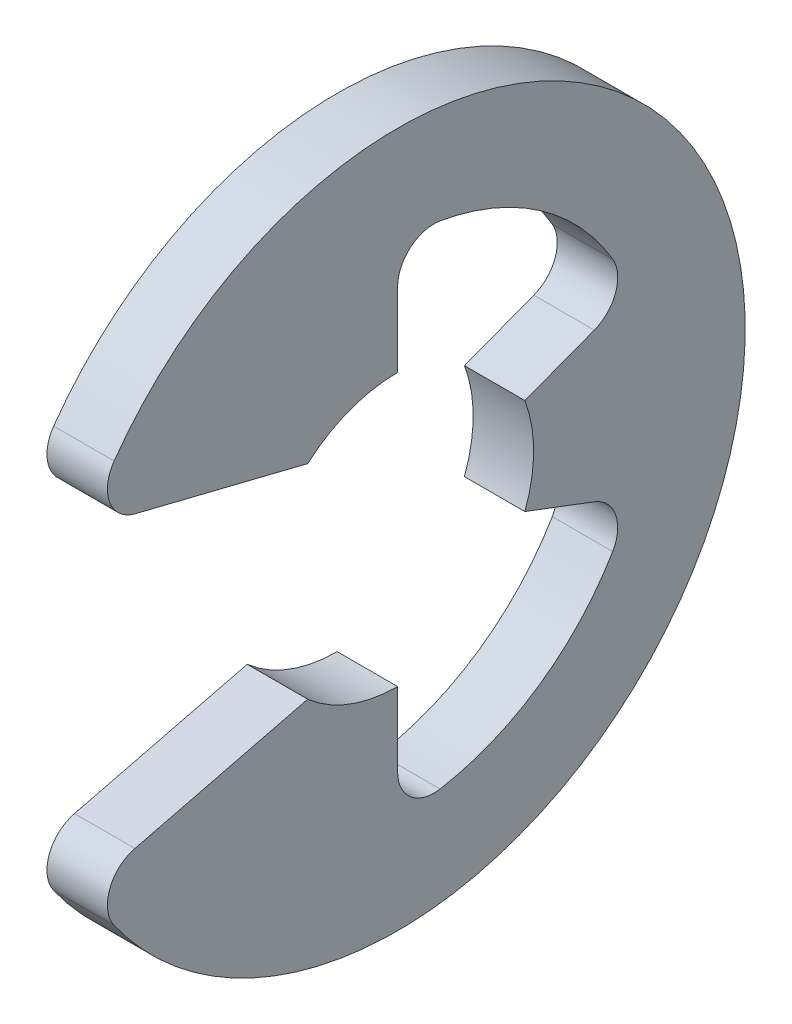
ISO-10303-21;
HEADER;
FILE_DESCRIPTION(('STEP AP214'),'2;1');
FILE_NAME('part.step','',(''),(''),'','','');
FILE_SCHEMA(('AUTOMOTIVE_DESIGN { 1 0 10303 214 1 1 1 1 }'));
ENDSEC;
DATA;
#1=APPLICATION_CONTEXT('core data for automotive mechanical design processes');
#2=APPLICATION_PROTOCOL_DEFINITION('international standard','automotive_design',2000,#1);
#3=PRODUCT_CONTEXT('',#1,'mechanical');
#4=PRODUCT('Part','Part','',(#3));
#5=PRODUCT_RELATED_PRODUCT_CATEGORY('part','',(#4));
#6=PRODUCT_DEFINITION_FORMATION('','',#4);
#7=PRODUCT_DEFINITION_CONTEXT('part definition',#1,'design');
#8=PRODUCT_DEFINITION('design','',#6,#7);
#9=PRODUCT_DEFINITION_SHAPE('','',#8);
#10=(LENGTH_UNIT() NAMED_UNIT(*) SI_UNIT(.MILLI.,.METRE.));
#11=(NAMED_UNIT(*) PLANE_ANGLE_UNIT() SI_UNIT($,.RADIAN.));
#12=(NAMED_UNIT(*) SI_UNIT($,.STERADIAN.) SOLID_ANGLE_UNIT());
#13=UNCERTAINTY_MEASURE_WITH_UNIT(LENGTH_MEASURE(1.E-05),#10,'distance_accuracy_value','');
#14=(GEOMETRIC_REPRESENTATION_CONTEXT(3) GLOBAL_UNCERTAINTY_ASSIGNED_CONTEXT((#13)) GLOBAL_UNIT_ASSIGNED_CONTEXT((#10,
#11,#12)) REPRESENTATION_CONTEXT('',''));
#15=CARTESIAN_POINT('',(0.,0.,0.));
#16=DIRECTION('',(0.,0.,1.));
#17=DIRECTION('',(1.,0.,0.));
#18=AXIS2_PLACEMENT_3D('',#15,#16,#17);
#19=CARTESIAN_POINT('',(-0.3,0.,0.));
#20=DIRECTION('',(1.,0.,0.));
#21=DIRECTION('',(0.,0.,-1.));
#22=AXIS2_PLACEMENT_3D('',#19,#20,#21);
#23=PLANE('',#22);
#24=CARTESIAN_POINT('',(-0.3,-1.78749999611696,2.52050466452294));
#25=DIRECTION('',(-1.,0.,0.));
#26=DIRECTION('',(0.,0.,1.));
#27=AXIS2_PLACEMENT_3D('',#24,#25,#26);
#28=CIRCLE('',#27,0.36);
#29=CARTESIAN_POINT('',(-0.3,-1.43810673734382,2.60724767994141));
#30=VERTEX_POINT('',#29);
#31=CARTESIAN_POINT('',(-0.3,-1.99575242284903,2.8141556933994));
#32=VERTEX_POINT('',#31);
#33=EDGE_CURVE('E204',#30,#32,#28,.F.);
#34=ORIENTED_EDGE('',*,*,#33,.F.);
#35=DIRECTION('',(0.,0.240952820606872,-0.970536829925373));
#36=VECTOR('',#35,1.);
#37=CARTESIAN_POINT('',(-0.3,-1.55535385551941,3.07950878942095));
#38=LINE('',#37,#36);
#39=CARTESIAN_POINT('',(-0.3,-1.0125,0.8929410674843));
#40=VERTEX_POINT('',#39);
#41=EDGE_CURVE('E208',#30,#40,#38,.T.);
#42=ORIENTED_EDGE('',*,*,#41,.T.);
#43=CARTESIAN_POINT('',(-0.3,0.,0.));
#44=DIRECTION('',(-1.,0.,0.));
#45=DIRECTION('',(0.,0.,1.));
#46=AXIS2_PLACEMENT_3D('',#43,#44,#45);
#47=CIRCLE('',#46,1.35);
#48=CARTESIAN_POINT('',(-0.3,-1.35,0.));
#49=VERTEX_POINT('',#48);
#50=EDGE_CURVE('E211',#49,#40,#47,.T.);
#51=ORIENTED_EDGE('',*,*,#50,.F.);
#52=DIRECTION('',(0.,1.,0.));
#53=VECTOR('',#52,1.);
#54=CARTESIAN_POINT('',(-0.3,0.,0.));
#55=LINE('',#54,#53);
#56=CARTESIAN_POINT('',(-0.3,-2.08659165249111,0.));
#57=VERTEX_POINT('',#56);
#58=EDGE_CURVE('E144',#57,#49,#55,.T.);
#59=ORIENTED_EDGE('',*,*,#58,.F.);
#60=CARTESIAN_POINT('',(-0.3,-2.08659165249111,-0.359999999999999));
#61=DIRECTION('',(-1.,0.,0.));
#62=DIRECTION('',(0.,0.,1.));
#63=AXIS2_PLACEMENT_3D('',#60,#61,#62);
#64=CIRCLE('',#63,0.36);
#65=CARTESIAN_POINT('',(-0.3,-2.44135037951428,-0.421206581352832));
#66=VERTEX_POINT('',#65);
#67=EDGE_CURVE('E20',#66,#57,#64,.T.);
#68=ORIENTED_EDGE('',*,*,#67,.F.);
#69=CARTESIAN_POINT('',(-0.3,0.,0.));
#70=DIRECTION('',(-1.,0.,0.));
#71=DIRECTION('',(0.,0.,1.));
#72=AXIS2_PLACEMENT_3D('',#69,#70,#71);
#73=CIRCLE('',#72,2.47741935483871);
#74=CARTESIAN_POINT('',(-0.3,-1.25715038342261,-2.13475515532574));
#75=VERTEX_POINT('',#74);
#76=EDGE_CURVE('E141',#66,#75,#73,.F.);
#77=ORIENTED_EDGE('',*,*,#76,.T.);
#78=CARTESIAN_POINT('',(-0.3,-1.07447071833151,-1.82454854681747));
#79=DIRECTION('',(-1.,0.,0.));
#80=DIRECTION('',(0.,0.,1.));
#81=AXIS2_PLACEMENT_3D('',#78,#79,#80);
#82=CIRCLE('',#81,0.36);
#83=CARTESIAN_POINT('',(-0.3,-0.737721553521855,-1.95182776743105));
#84=VERTEX_POINT('',#83);
#85=EDGE_CURVE('E167',#75,#84,#82,.F.);
#86=ORIENTED_EDGE('',*,*,#85,.T.);
#87=DIRECTION('',(0.,0.353553390593277,0.935414346693484));
#88=VECTOR('',#87,1.);
#89=CARTESIAN_POINT('',(-0.3,-0.477297077300919,-1.26280936803621));
#90=LINE('',#89,#88);
#91=CARTESIAN_POINT('',(-0.3,-0.477297077300919,-1.26280936803621));
#92=VERTEX_POINT('',#91);
#93=EDGE_CURVE('E170',#84,#92,#90,.T.);
#94=ORIENTED_EDGE('',*,*,#93,.T.);
#95=CARTESIAN_POINT('',(-0.3,0.,0.));
#96=DIRECTION('',(-1.,0.,0.));
#97=DIRECTION('',(0.,0.,1.));
#98=AXIS2_PLACEMENT_3D('',#95,#96,#97);
#99=CIRCLE('',#98,1.35);
#100=CARTESIAN_POINT('',(-0.3,0.477297077300919,-1.26280936803621));
#101=VERTEX_POINT('',#100);
#102=EDGE_CURVE('E171',#92,#101,#99,.F.);
#103=ORIENTED_EDGE('',*,*,#102,.T.);
#104=DIRECTION('',(0.,0.353553390593278,-0.935414346693484));
#105=VECTOR('',#104,1.);
#106=CARTESIAN_POINT('',(-0.3,0.477297077300919,-1.26280936803621));
#107=LINE('',#106,#105);
#108=CARTESIAN_POINT('',(-0.3,0.737721553521856,-1.95182776743105));
#109=VERTEX_POINT('',#108);
#110=EDGE_CURVE('E176',#101,#109,#107,.T.);
#111=ORIENTED_EDGE('',*,*,#110,.T.);
#112=CARTESIAN_POINT('',(-0.3,1.07447071833151,-1.82454854681747));
#113=DIRECTION('',(-1.,0.,0.));
#114=DIRECTION('',(0.,0.,1.));
#115=AXIS2_PLACEMENT_3D('',#112,#113,#114);
#116=CIRCLE('',#115,0.36);
#117=CARTESIAN_POINT('',(-0.3,1.25715038342261,-2.13475515532574));
#118=VERTEX_POINT('',#117);
#119=EDGE_CURVE('E179',#109,#118,#116,.F.);
#120=ORIENTED_EDGE('',*,*,#119,.T.);
#121=CARTESIAN_POINT('',(-0.3,0.,0.));
#122=DIRECTION('',(-1.,0.,0.));
#123=DIRECTION('',(0.,0.,1.));
#124=AXIS2_PLACEMENT_3D('',#121,#122,#123);
#125=CIRCLE('',#124,2.47741935483871);
#126=CARTESIAN_POINT('',(-0.3,2.44135037951428,-0.421206581352832));
#127=VERTEX_POINT('',#126);
#128=EDGE_CURVE('E182',#118,#127,#125,.F.);
#129=ORIENTED_EDGE('',*,*,#128,.T.);
#130=CARTESIAN_POINT('',(-0.3,2.08659165249111,-0.359999999999998));
#131=DIRECTION('',(-1.,0.,0.));
#132=DIRECTION('',(0.,0.,1.));
#133=AXIS2_PLACEMENT_3D('',#130,#131,#132);
#134=CIRCLE('',#133,0.36);
#135=CARTESIAN_POINT('',(-0.3,2.08659165249111,0.));
#136=VERTEX_POINT('',#135);
#137=EDGE_CURVE('E185',#127,#136,#134,.F.);
#138=ORIENTED_EDGE('',*,*,#137,.T.);
#139=DIRECTION('',(0.,-1.,0.));
#140=VECTOR('',#139,1.);
#141=CARTESIAN_POINT('',(-0.3,1.35,0.));
#142=LINE('',#141,#140);
#143=CARTESIAN_POINT('',(-0.3,1.35,0.));
#144=VERTEX_POINT('',#143);
#145=EDGE_CURVE('E188',#136,#144,#142,.T.);
#146=ORIENTED_EDGE('',*,*,#145,.T.);
#147=CARTESIAN_POINT('',(-0.3,0.,0.));
#148=DIRECTION('',(-1.,0.,0.));
#149=DIRECTION('',(0.,0.,1.));
#150=AXIS2_PLACEMENT_3D('',#147,#148,#149);
#151=CIRCLE('',#150,1.35);
#152=CARTESIAN_POINT('',(-0.3,1.0125,0.8929410674843));
#153=VERTEX_POINT('',#152);
#154=EDGE_CURVE('E189',#144,#153,#151,.F.);
#155=ORIENTED_EDGE('',*,*,#154,.T.);
#156=DIRECTION('',(0.,0.240952820606871,0.970536829925373));
#157=VECTOR('',#156,1.);
#158=CARTESIAN_POINT('',(-0.3,1.55535385551941,3.07950878942095));
#159=LINE('',#158,#157);
#160=CARTESIAN_POINT('',(-0.3,1.43810673734382,2.60724767994141));
#161=VERTEX_POINT('',#160);
#162=EDGE_CURVE('E195',#153,#161,#159,.T.);
#163=ORIENTED_EDGE('',*,*,#162,.T.);
#164=CARTESIAN_POINT('',(-0.3,1.78749999611695,2.52050466452294));
#165=DIRECTION('',(-1.,0.,0.));
#166=DIRECTION('',(0.,0.,1.));
#167=AXIS2_PLACEMENT_3D('',#164,#165,#166);
#168=CIRCLE('',#167,0.36);
#169=CARTESIAN_POINT('',(-0.3,1.99575242284903,2.8141556933994));
#170=VERTEX_POINT('',#169);
#171=EDGE_CURVE('E199',#170,#161,#168,.F.);
#172=ORIENTED_EDGE('',*,*,#171,.F.);
#173=CARTESIAN_POINT('',(-0.3,0.,0.));
#174=DIRECTION('',(-1.,0.,0.));
#175=DIRECTION('',(0.,0.,1.));
#176=AXIS2_PLACEMENT_3D('',#173,#174,#175);
#177=CIRCLE('',#176,3.45);
#178=EDGE_CURVE('E200',#32,#170,#177,.F.);
#179=ORIENTED_EDGE('',*,*,#178,.F.);
#180=EDGE_LOOP('',(#34,#42,#51,#59,#68,#77,#86,#94,#103,#111,#120,#129,#138,#146,#155,#163,#172,#179));
#181=FACE_BOUND('',#180,.T.);
#182=ADVANCED_FACE('F17',(#181),#23,.F.);
#183=CARTESIAN_POINT('',(0.3,-1.55535385551941,3.07950878942095));
#184=DIRECTION('',(0.,-0.970536829925373,-0.240952820606872));
#185=DIRECTION('',(0.,0.240952820606872,-0.970536829925373));
#186=AXIS2_PLACEMENT_3D('',#183,#184,#185);
#187=PLANE('',#186);
#188=DIRECTION('',(-1.,0.,0.));
#189=VECTOR('',#188,1.);
#190=CARTESIAN_POINT('',(0.3,-1.43810673734382,2.60724767994141));
#191=LINE('',#190,#189);
#192=CARTESIAN_POINT('',(0.3,-1.43810673734382,2.60724767994141));
#193=VERTEX_POINT('',#192);
#194=EDGE_CURVE('E205',#193,#30,#191,.T.);
#195=ORIENTED_EDGE('',*,*,#194,.F.);
#196=DIRECTION('',(0.,-0.240952820606872,0.970536829925373));
#197=VECTOR('',#196,1.);
#198=CARTESIAN_POINT('',(0.3,-1.0125,0.8929410674843));
#199=LINE('',#198,#197);
#200=CARTESIAN_POINT('',(0.3,-1.0125,0.8929410674843));
#201=VERTEX_POINT('',#200);
#202=EDGE_CURVE('E250',#201,#193,#199,.T.);
#203=ORIENTED_EDGE('',*,*,#202,.F.);
#204=DIRECTION('',(-1.,0.,0.));
#205=VECTOR('',#204,1.);
#206=CARTESIAN_POINT('',(0.3,-1.0125,0.8929410674843));
#207=LINE('',#206,#205);
#208=EDGE_CURVE('E268',#201,#40,#207,.T.);
#209=ORIENTED_EDGE('',*,*,#208,.T.);
#210=ORIENTED_EDGE('',*,*,#41,.F.);
#211=EDGE_LOOP('',(#195,#203,#209,#210));
#212=FACE_BOUND('',#211,.T.);
#213=ADVANCED_FACE('F272',(#212),#187,.F.);
#214=CARTESIAN_POINT('',(0.3,-1.78749999611696,2.52050466452294));
#215=DIRECTION('',(-1.,0.,0.));
#216=DIRECTION('',(0.,0.,1.));
#217=AXIS2_PLACEMENT_3D('',#214,#215,#216);
#218=CYLINDRICAL_SURFACE('',#217,0.36);
#219=ORIENTED_EDGE('',*,*,#33,.T.);
#220=DIRECTION('',(-1.,0.,0.));
#221=VECTOR('',#220,1.);
#222=CARTESIAN_POINT('',(0.3,-1.99575242284903,2.8141556933994));
#223=LINE('',#222,#221);
#224=CARTESIAN_POINT('',(0.3,-1.99575242284903,2.8141556933994));
#225=VERTEX_POINT('',#224);
#226=EDGE_CURVE('E201',#225,#32,#223,.T.);
#227=ORIENTED_EDGE('',*,*,#226,.F.);
#228=CARTESIAN_POINT('',(0.3,-1.78749999611696,2.52050466452294));
#229=DIRECTION('',(-1.,0.,0.));
#230=DIRECTION('',(0.,0.,1.));
#231=AXIS2_PLACEMENT_3D('',#228,#229,#230);
#232=CIRCLE('',#231,0.36);
#233=EDGE_CURVE('E249',#193,#225,#232,.F.);
#234=ORIENTED_EDGE('',*,*,#233,.F.);
#235=ORIENTED_EDGE('',*,*,#194,.T.);
#236=EDGE_LOOP('',(#219,#227,#234,#235));
#237=FACE_BOUND('',#236,.T.);
#238=ADVANCED_FACE('F449',(#237),#218,.T.);
#239=CARTESIAN_POINT('',(0.3,0.,0.));
#240=DIRECTION('',(-1.,0.,0.));
#241=DIRECTION('',(0.,0.,1.));
#242=AXIS2_PLACEMENT_3D('',#239,#240,#241);
#243=CYLINDRICAL_SURFACE('',#242,3.45);
#244=ORIENTED_EDGE('',*,*,#178,.T.);
#245=DIRECTION('',(-1.,0.,0.));
#246=VECTOR('',#245,1.);
#247=CARTESIAN_POINT('',(0.3,1.99575242284903,2.8141556933994));
#248=LINE('',#247,#246);
#249=CARTESIAN_POINT('',(0.3,1.99575242284903,2.8141556933994));
#250=VERTEX_POINT('',#249);
#251=EDGE_CURVE('E196',#250,#170,#248,.T.);
#252=ORIENTED_EDGE('',*,*,#251,.F.);
#253=CARTESIAN_POINT('',(0.3,0.,0.));
#254=DIRECTION('',(-1.,0.,0.));
#255=DIRECTION('',(0.,0.,1.));
#256=AXIS2_PLACEMENT_3D('',#253,#254,#255);
#257=CIRCLE('',#256,3.45);
#258=EDGE_CURVE('E246',#225,#250,#257,.F.);
#259=ORIENTED_EDGE('',*,*,#258,.F.);
#260=ORIENTED_EDGE('',*,*,#226,.T.);
#261=EDGE_LOOP('',(#244,#252,#259,#260));
#262=FACE_BOUND('',#261,.T.);
#263=ADVANCED_FACE('F439',(#262),#243,.T.);
#264=CARTESIAN_POINT('',(0.3,1.78749999611695,2.52050466452294));
#265=DIRECTION('',(-1.,0.,0.));
#266=DIRECTION('',(0.,0.,1.));
#267=AXIS2_PLACEMENT_3D('',#264,#265,#266);
#268=CYLINDRICAL_SURFACE('',#267,0.36);
#269=ORIENTED_EDGE('',*,*,#171,.T.);
#270=DIRECTION('',(1.,0.,0.));
#271=VECTOR('',#270,1.);
#272=CARTESIAN_POINT('',(0.3,1.43810673734382,2.60724767994141));
#273=LINE('',#272,#271);
#274=CARTESIAN_POINT('',(0.3,1.43810673734382,2.60724767994141));
#275=VERTEX_POINT('',#274);
#276=EDGE_CURVE('E192',#161,#275,#273,.T.);
#277=ORIENTED_EDGE('',*,*,#276,.T.);
#278=CARTESIAN_POINT('',(0.3,1.78749999611695,2.52050466452294));
#279=DIRECTION('',(-1.,0.,0.));
#280=DIRECTION('',(0.,0.,1.));
#281=AXIS2_PLACEMENT_3D('',#278,#279,#280);
#282=CIRCLE('',#281,0.36);
#283=EDGE_CURVE('E244',#250,#275,#282,.F.);
#284=ORIENTED_EDGE('',*,*,#283,.F.);
#285=ORIENTED_EDGE('',*,*,#251,.T.);
#286=EDGE_LOOP('',(#269,#277,#284,#285));
#287=FACE_BOUND('',#286,.T.);
#288=ADVANCED_FACE('F429',(#287),#268,.T.);
#289=CARTESIAN_POINT('',(0.3,1.55535385551941,3.07950878942095));
#290=DIRECTION('',(0.,0.970536829925373,-0.240952820606871));
#291=DIRECTION('',(0.,0.240952820606871,0.970536829925373));
#292=AXIS2_PLACEMENT_3D('',#289,#290,#291);
#293=PLANE('',#292);
#294=ORIENTED_EDGE('',*,*,#276,.F.);
#295=ORIENTED_EDGE('',*,*,#162,.F.);
#296=DIRECTION('',(-1.,0.,0.));
#297=VECTOR('',#296,1.);
#298=CARTESIAN_POINT('',(0.3,1.0125,0.8929410674843));
#299=LINE('',#298,#297);
#300=CARTESIAN_POINT('',(0.3,1.0125,0.8929410674843));
#301=VERTEX_POINT('',#300);
#302=EDGE_CURVE('E190',#153,#301,#299,.F.);
#303=ORIENTED_EDGE('',*,*,#302,.T.);
#304=DIRECTION('',(0.,-0.240952820606871,-0.970536829925373));
#305=VECTOR('',#304,1.);
#306=CARTESIAN_POINT('',(0.3,1.43810673734382,2.60724767994141));
#307=LINE('',#306,#305);
#308=EDGE_CURVE('E243',#275,#301,#307,.T.);
#309=ORIENTED_EDGE('',*,*,#308,.F.);
#310=EDGE_LOOP('',(#294,#295,#303,#309));
#311=FACE_BOUND('',#310,.T.);
#312=ADVANCED_FACE('F419',(#311),#293,.F.);
#313=CARTESIAN_POINT('',(0.3,0.,0.));
#314=DIRECTION('',(-1.,0.,0.));
#315=DIRECTION('',(0.,0.,1.));
#316=AXIS2_PLACEMENT_3D('',#313,#314,#315);
#317=CYLINDRICAL_SURFACE('',#316,1.35);
#318=DIRECTION('',(1.,0.,0.));
#319=VECTOR('',#318,1.);
#320=CARTESIAN_POINT('',(0.3,1.35,0.));
#321=LINE('',#320,#319);
#322=CARTESIAN_POINT('',(0.3,1.35,0.));
#323=VERTEX_POINT('',#322);
#324=EDGE_CURVE('E186',#144,#323,#321,.T.);
#325=ORIENTED_EDGE('',*,*,#324,.T.);
#326=CARTESIAN_POINT('',(0.3,0.,0.));
#327=DIRECTION('',(-1.,0.,0.));
#328=DIRECTION('',(0.,0.,1.));
#329=AXIS2_PLACEMENT_3D('',#326,#327,#328);
#330=CIRCLE('',#329,1.35);
#331=EDGE_CURVE('E240',#301,#323,#330,.T.);
#332=ORIENTED_EDGE('',*,*,#331,.F.);
#333=ORIENTED_EDGE('',*,*,#302,.F.);
#334=ORIENTED_EDGE('',*,*,#154,.F.);
#335=EDGE_LOOP('',(#325,#332,#333,#334));
#336=FACE_BOUND('',#335,.T.);
#337=ADVANCED_FACE('F409',(#336),#317,.F.);
#338=CARTESIAN_POINT('',(0.3,1.35,0.));
#339=DIRECTION('',(0.,0.,1.));
#340=DIRECTION('',(0.,-1.,0.));
#341=AXIS2_PLACEMENT_3D('',#338,#339,#340);
#342=PLANE('',#341);
#343=DIRECTION('',(-1.,0.,0.));
#344=VECTOR('',#343,1.);
#345=CARTESIAN_POINT('',(0.3,2.08659165249111,0.));
#346=LINE('',#345,#344);
#347=CARTESIAN_POINT('',(0.3,2.08659165249111,0.));
#348=VERTEX_POINT('',#347);
#349=EDGE_CURVE('E183',#136,#348,#346,.F.);
#350=ORIENTED_EDGE('',*,*,#349,.T.);
#351=DIRECTION('',(0.,1.,0.));
#352=VECTOR('',#351,1.);
#353=CARTESIAN_POINT('',(0.3,0.,0.));
#354=LINE('',#353,#352);
#355=EDGE_CURVE('E239',#323,#348,#354,.T.);
#356=ORIENTED_EDGE('',*,*,#355,.F.);
#357=ORIENTED_EDGE('',*,*,#324,.F.);
#358=ORIENTED_EDGE('',*,*,#145,.F.);
#359=EDGE_LOOP('',(#350,#356,#357,#358));
#360=FACE_BOUND('',#359,.T.);
#361=ADVANCED_FACE('F399',(#360),#342,.F.);
#362=CARTESIAN_POINT('',(0.3,2.08659165249111,-0.359999999999998));
#363=DIRECTION('',(-1.,0.,0.));
#364=DIRECTION('',(0.,0.,1.));
#365=AXIS2_PLACEMENT_3D('',#362,#363,#364);
#366=CYLINDRICAL_SURFACE('',#365,0.36);
#367=ORIENTED_EDGE('',*,*,#349,.F.);
#368=ORIENTED_EDGE('',*,*,#137,.F.);
#369=DIRECTION('',(-1.,0.,0.));
#370=VECTOR('',#369,1.);
#371=CARTESIAN_POINT('',(0.3,2.44135037951428,-0.421206581352832));
#372=LINE('',#371,#370);
#373=CARTESIAN_POINT('',(0.3,2.44135037951428,-0.421206581352832));
#374=VERTEX_POINT('',#373);
#375=EDGE_CURVE('E180',#127,#374,#372,.F.);
#376=ORIENTED_EDGE('',*,*,#375,.T.);
#377=CARTESIAN_POINT('',(0.3,2.08659165249111,-0.359999999999998));
#378=DIRECTION('',(-1.,0.,0.));
#379=DIRECTION('',(0.,0.,1.));
#380=AXIS2_PLACEMENT_3D('',#377,#378,#379);
#381=CIRCLE('',#380,0.36);
#382=EDGE_CURVE('E236',#348,#374,#381,.T.);
#383=ORIENTED_EDGE('',*,*,#382,.F.);
#384=EDGE_LOOP('',(#367,#368,#376,#383));
#385=FACE_BOUND('',#384,.T.);
#386=ADVANCED_FACE('F389',(#385),#366,.F.);
#387=CARTESIAN_POINT('',(0.3,0.,0.));
#388=DIRECTION('',(-1.,0.,0.));
#389=DIRECTION('',(0.,0.,1.));
#390=AXIS2_PLACEMENT_3D('',#387,#388,#389);
#391=CYLINDRICAL_SURFACE('',#390,2.47741935483871);
#392=ORIENTED_EDGE('',*,*,#375,.F.);
#393=ORIENTED_EDGE('',*,*,#128,.F.);
#394=DIRECTION('',(-1.,0.,0.));
#395=VECTOR('',#394,1.);
#396=CARTESIAN_POINT('',(0.3,1.25715038342261,-2.13475515532574));
#397=LINE('',#396,#395);
#398=CARTESIAN_POINT('',(0.3,1.25715038342261,-2.13475515532574));
#399=VERTEX_POINT('',#398);
#400=EDGE_CURVE('E177',#118,#399,#397,.F.);
#401=ORIENTED_EDGE('',*,*,#400,.T.);
#402=CARTESIAN_POINT('',(0.3,0.,0.));
#403=DIRECTION('',(-1.,0.,0.));
#404=DIRECTION('',(0.,0.,1.));
#405=AXIS2_PLACEMENT_3D('',#402,#403,#404);
#406=CIRCLE('',#405,2.47741935483871);
#407=EDGE_CURVE('E233',#374,#399,#406,.T.);
#408=ORIENTED_EDGE('',*,*,#407,.F.);
#409=EDGE_LOOP('',(#392,#393,#401,#408));
#410=FACE_BOUND('',#409,.T.);
#411=ADVANCED_FACE('F379',(#410),#391,.F.);
#412=CARTESIAN_POINT('',(0.3,1.07447071833151,-1.82454854681747));
#413=DIRECTION('',(-1.,0.,0.));
#414=DIRECTION('',(0.,0.,1.));
#415=AXIS2_PLACEMENT_3D('',#412,#413,#414);
#416=CYLINDRICAL_SURFACE('',#415,0.36);
#417=ORIENTED_EDGE('',*,*,#400,.F.);
#418=ORIENTED_EDGE('',*,*,#119,.F.);
#419=DIRECTION('',(1.,0.,0.));
#420=VECTOR('',#419,1.);
#421=CARTESIAN_POINT('',(0.3,0.737721553521856,-1.95182776743105));
#422=LINE('',#421,#420);
#423=CARTESIAN_POINT('',(0.3,0.737721553521856,-1.95182776743105));
#424=VERTEX_POINT('',#423);
#425=EDGE_CURVE('E174',#109,#424,#422,.T.);
#426=ORIENTED_EDGE('',*,*,#425,.T.);
#427=CARTESIAN_POINT('',(0.3,1.07447071833151,-1.82454854681747));
#428=DIRECTION('',(-1.,0.,0.));
#429=DIRECTION('',(0.,0.,1.));
#430=AXIS2_PLACEMENT_3D('',#427,#428,#429);
#431=CIRCLE('',#430,0.36);
#432=EDGE_CURVE('E230',#399,#424,#431,.T.);
#433=ORIENTED_EDGE('',*,*,#432,.F.);
#434=EDGE_LOOP('',(#417,#418,#426,#433));
#435=FACE_BOUND('',#434,.T.);
#436=ADVANCED_FACE('F369',(#435),#416,.F.);
#437=CARTESIAN_POINT('',(0.3,0.477297077300919,-1.26280936803621));
#438=DIRECTION('',(0.,-0.935414346693484,-0.353553390593278));
#439=DIRECTION('',(0.,0.353553390593278,-0.935414346693484));
#440=AXIS2_PLACEMENT_3D('',#437,#438,#439);
#441=PLANE('',#440);
#442=ORIENTED_EDGE('',*,*,#425,.F.);
#443=ORIENTED_EDGE('',*,*,#110,.F.);
#444=DIRECTION('',(-1.,0.,0.));
#445=VECTOR('',#444,1.);
#446=CARTESIAN_POINT('',(0.3,0.477297077300919,-1.26280936803621));
#447=LINE('',#446,#445);
#448=CARTESIAN_POINT('',(0.3,0.477297077300919,-1.26280936803621));
#449=VERTEX_POINT('',#448);
#450=EDGE_CURVE('E172',#101,#449,#447,.F.);
#451=ORIENTED_EDGE('',*,*,#450,.T.);
#452=DIRECTION('',(0.,-0.353553390593278,0.935414346693484));
#453=VECTOR('',#452,1.);
#454=CARTESIAN_POINT('',(0.3,0.737721553521856,-1.95182776743105));
#455=LINE('',#454,#453);
#456=EDGE_CURVE('E229',#424,#449,#455,.T.);
#457=ORIENTED_EDGE('',*,*,#456,.F.);
#458=EDGE_LOOP('',(#442,#443,#451,#457));
#459=FACE_BOUND('',#458,.T.);
#460=ADVANCED_FACE('F359',(#459),#441,.F.);
#461=CARTESIAN_POINT('',(0.3,0.,0.));
#462=DIRECTION('',(-1.,0.,0.));
#463=DIRECTION('',(0.,0.,1.));
#464=AXIS2_PLACEMENT_3D('',#461,#462,#463);
#465=CYLINDRICAL_SURFACE('',#464,1.35);
#466=DIRECTION('',(1.,0.,0.));
#467=VECTOR('',#466,1.);
#468=CARTESIAN_POINT('',(0.3,-0.477297077300919,-1.26280936803621));
#469=LINE('',#468,#467);
#470=CARTESIAN_POINT('',(0.3,-0.477297077300919,-1.26280936803621));
#471=VERTEX_POINT('',#470);
#472=EDGE_CURVE('E168',#92,#471,#469,.T.);
#473=ORIENTED_EDGE('',*,*,#472,.T.);
#474=CARTESIAN_POINT('',(0.3,0.,0.));
#475=DIRECTION('',(-1.,0.,0.));
#476=DIRECTION('',(0.,0.,1.));
#477=AXIS2_PLACEMENT_3D('',#474,#475,#476);
#478=CIRCLE('',#477,1.35);
#479=EDGE_CURVE('E226',#449,#471,#478,.T.);
#480=ORIENTED_EDGE('',*,*,#479,.F.);
#481=ORIENTED_EDGE('',*,*,#450,.F.);
#482=ORIENTED_EDGE('',*,*,#102,.F.);
#483=EDGE_LOOP('',(#473,#480,#481,#482));
#484=FACE_BOUND('',#483,.T.);
#485=ADVANCED_FACE('F349',(#484),#465,.F.);
#486=CARTESIAN_POINT('',(0.3,-0.477297077300919,-1.26280936803621));
#487=DIRECTION('',(0.,0.935414346693484,-0.353553390593277));
#488=DIRECTION('',(0.,0.353553390593277,0.935414346693484));
#489=AXIS2_PLACEMENT_3D('',#486,#487,#488);
#490=PLANE('',#489);
#491=DIRECTION('',(-1.,0.,0.));
#492=VECTOR('',#491,1.);
#493=CARTESIAN_POINT('',(0.3,-0.737721553521856,-1.95182776743105));
#494=LINE('',#493,#492);
#495=CARTESIAN_POINT('',(0.3,-0.737721553521855,-1.95182776743105));
#496=VERTEX_POINT('',#495);
#497=EDGE_CURVE('E165',#84,#496,#494,.F.);
#498=ORIENTED_EDGE('',*,*,#497,.T.);
#499=DIRECTION('',(0.,-0.353553390593277,-0.935414346693484));
#500=VECTOR('',#499,1.);
#501=CARTESIAN_POINT('',(0.3,-0.477297077300919,-1.26280936803621));
#502=LINE('',#501,#500);
#503=EDGE_CURVE('E225',#471,#496,#502,.T.);
#504=ORIENTED_EDGE('',*,*,#503,.F.);
#505=ORIENTED_EDGE('',*,*,#472,.F.);
#506=ORIENTED_EDGE('',*,*,#93,.F.);
#507=EDGE_LOOP('',(#498,#504,#505,#506));
#508=FACE_BOUND('',#507,.T.);
#509=ADVANCED_FACE('F339',(#508),#490,.F.);
#510=CARTESIAN_POINT('',(0.3,-1.07447071833151,-1.82454854681747));
#511=DIRECTION('',(-1.,0.,0.));
#512=DIRECTION('',(0.,0.,1.));
#513=AXIS2_PLACEMENT_3D('',#510,#511,#512);
#514=CYLINDRICAL_SURFACE('',#513,0.36);
#515=ORIENTED_EDGE('',*,*,#497,.F.);
#516=ORIENTED_EDGE('',*,*,#85,.F.);
#517=DIRECTION('',(-1.,0.,0.));
#518=VECTOR('',#517,1.);
#519=CARTESIAN_POINT('',(0.3,-1.25715038342261,-2.13475515532574));
#520=LINE('',#519,#518);
#521=CARTESIAN_POINT('',(0.3,-1.25715038342261,-2.13475515532574));
#522=VERTEX_POINT('',#521);
#523=EDGE_CURVE('E153',#75,#522,#520,.F.);
#524=ORIENTED_EDGE('',*,*,#523,.T.);
#525=CARTESIAN_POINT('',(0.3,-1.07447071833151,-1.82454854681747));
#526=DIRECTION('',(-1.,0.,0.));
#527=DIRECTION('',(0.,0.,1.));
#528=AXIS2_PLACEMENT_3D('',#525,#526,#527);
#529=CIRCLE('',#528,0.36);
#530=EDGE_CURVE('E222',#496,#522,#529,.T.);
#531=ORIENTED_EDGE('',*,*,#530,.F.);
#532=EDGE_LOOP('',(#515,#516,#524,#531));
#533=FACE_BOUND('',#532,.T.);
#534=ADVANCED_FACE('F330',(#533),#514,.F.);
#535=CARTESIAN_POINT('',(0.3,0.,0.));
#536=DIRECTION('',(-1.,0.,0.));
#537=DIRECTION('',(0.,0.,1.));
#538=AXIS2_PLACEMENT_3D('',#535,#536,#537);
#539=CYLINDRICAL_SURFACE('',#538,2.47741935483871);
#540=DIRECTION('',(-1.,0.,0.));
#541=VECTOR('',#540,1.);
#542=CARTESIAN_POINT('',(0.3,-2.44135037951428,-0.421206581352832));
#543=LINE('',#542,#541);
#544=CARTESIAN_POINT('',(0.3,-2.44135037951428,-0.421206581352832));
#545=VERTEX_POINT('',#544);
#546=EDGE_CURVE('E151',#66,#545,#543,.F.);
#547=ORIENTED_EDGE('',*,*,#546,.T.);
#548=CARTESIAN_POINT('',(0.3,0.,0.));
#549=DIRECTION('',(-1.,0.,0.));
#550=DIRECTION('',(0.,0.,1.));
#551=AXIS2_PLACEMENT_3D('',#548,#549,#550);
#552=CIRCLE('',#551,2.47741935483871);
#553=EDGE_CURVE('E220',#522,#545,#552,.T.);
#554=ORIENTED_EDGE('',*,*,#553,.F.);
#555=ORIENTED_EDGE('',*,*,#523,.F.);
#556=ORIENTED_EDGE('',*,*,#76,.F.);
#557=EDGE_LOOP('',(#547,#554,#555,#556));
#558=FACE_BOUND('',#557,.T.);
#559=ADVANCED_FACE('F149',(#558),#539,.F.);
#560=CARTESIAN_POINT('',(0.3,-2.08659165249111,-0.359999999999999));
#561=DIRECTION('',(-1.,0.,0.));
#562=DIRECTION('',(0.,0.,1.));
#563=AXIS2_PLACEMENT_3D('',#560,#561,#562);
#564=CYLINDRICAL_SURFACE('',#563,0.36);
#565=ORIENTED_EDGE('',*,*,#546,.F.);
#566=ORIENTED_EDGE('',*,*,#67,.T.);
#567=DIRECTION('',(1.,0.,0.));
#568=VECTOR('',#567,1.);
#569=CARTESIAN_POINT('',(0.3,-2.08659165249111,0.));
#570=LINE('',#569,#568);
#571=CARTESIAN_POINT('',(0.3,-2.08659165249111,0.));
#572=VERTEX_POINT('',#571);
#573=EDGE_CURVE('E159',#57,#572,#570,.T.);
#574=ORIENTED_EDGE('',*,*,#573,.T.);
#575=CARTESIAN_POINT('',(0.3,-2.08659165249111,-0.359999999999999));
#576=DIRECTION('',(-1.,0.,0.));
#577=DIRECTION('',(0.,0.,1.));
#578=AXIS2_PLACEMENT_3D('',#575,#576,#577);
#579=CIRCLE('',#578,0.36);
#580=EDGE_CURVE('E157',#545,#572,#579,.T.);
#581=ORIENTED_EDGE('',*,*,#580,.F.);
#582=EDGE_LOOP('',(#565,#566,#574,#581));
#583=FACE_BOUND('',#582,.T.);
#584=ADVANCED_FACE('F155',(#583),#564,.F.);
#585=CARTESIAN_POINT('',(0.3,-1.35,0.));
#586=DIRECTION('',(0.,0.,1.));
#587=DIRECTION('',(0.,-1.,0.));
#588=AXIS2_PLACEMENT_3D('',#585,#586,#587);
#589=PLANE('',#588);
#590=ORIENTED_EDGE('',*,*,#573,.F.);
#591=ORIENTED_EDGE('',*,*,#58,.T.);
#592=DIRECTION('',(-1.,0.,0.));
#593=VECTOR('',#592,1.);
#594=CARTESIAN_POINT('',(0.3,-1.35,0.));
#595=LINE('',#594,#593);
#596=CARTESIAN_POINT('',(0.3,-1.35,0.));
#597=VERTEX_POINT('',#596);
#598=EDGE_CURVE('E35',#49,#597,#595,.F.);
#599=ORIENTED_EDGE('',*,*,#598,.T.);
#600=DIRECTION('',(0.,1.,0.));
#601=VECTOR('',#600,1.);
#602=CARTESIAN_POINT('',(0.3,0.,0.));
#603=LINE('',#602,#601);
#604=EDGE_CURVE('E26',#572,#597,#603,.T.);
#605=ORIENTED_EDGE('',*,*,#604,.F.);
#606=EDGE_LOOP('',(#590,#591,#599,#605));
#607=FACE_BOUND('',#606,.T.);
#608=ADVANCED_FACE('F288',(#607),#589,.F.);
#609=CARTESIAN_POINT('',(0.3,0.,0.));
#610=DIRECTION('',(-1.,0.,0.));
#611=DIRECTION('',(0.,0.,1.));
#612=AXIS2_PLACEMENT_3D('',#609,#610,#611);
#613=CYLINDRICAL_SURFACE('',#612,1.35);
#614=ORIENTED_EDGE('',*,*,#208,.F.);
#615=CARTESIAN_POINT('',(0.3,0.,0.));
#616=DIRECTION('',(-1.,0.,0.));
#617=DIRECTION('',(0.,0.,1.));
#618=AXIS2_PLACEMENT_3D('',#615,#616,#617);
#619=CIRCLE('',#618,1.35);
#620=EDGE_CURVE('E11',#597,#201,#619,.T.);
#621=ORIENTED_EDGE('',*,*,#620,.F.);
#622=ORIENTED_EDGE('',*,*,#598,.F.);
#623=ORIENTED_EDGE('',*,*,#50,.T.);
#624=EDGE_LOOP('',(#614,#621,#622,#623));
#625=FACE_BOUND('',#624,.T.);
#626=ADVANCED_FACE('F266',(#625),#613,.F.);
#627=CARTESIAN_POINT('',(0.3,0.,0.));
#628=DIRECTION('',(1.,0.,0.));
#629=DIRECTION('',(0.,0.,-1.));
#630=AXIS2_PLACEMENT_3D('',#627,#628,#629);
#631=PLANE('',#630);
#632=ORIENTED_EDGE('',*,*,#604,.T.);
#633=ORIENTED_EDGE('',*,*,#620,.T.);
#634=ORIENTED_EDGE('',*,*,#202,.T.);
#635=ORIENTED_EDGE('',*,*,#233,.T.);
#636=ORIENTED_EDGE('',*,*,#258,.T.);
#637=ORIENTED_EDGE('',*,*,#283,.T.);
#638=ORIENTED_EDGE('',*,*,#308,.T.);
#639=ORIENTED_EDGE('',*,*,#331,.T.);
#640=ORIENTED_EDGE('',*,*,#355,.T.);
#641=ORIENTED_EDGE('',*,*,#382,.T.);
#642=ORIENTED_EDGE('',*,*,#407,.T.);
#643=ORIENTED_EDGE('',*,*,#432,.T.);
#644=ORIENTED_EDGE('',*,*,#456,.T.);
#645=ORIENTED_EDGE('',*,*,#479,.T.);
#646=ORIENTED_EDGE('',*,*,#503,.T.);
#647=ORIENTED_EDGE('',*,*,#530,.T.);
#648=ORIENTED_EDGE('',*,*,#553,.T.);
#649=ORIENTED_EDGE('',*,*,#580,.T.);
#650=EDGE_LOOP('',(#632,#633,#634,#635,#636,#637,#638,#639,#640,#641,#642,#643,#644,#645,#646,
#647,#648,#649));
#651=FACE_BOUND('',#650,.T.);
#652=ADVANCED_FACE('F287',(#651),#631,.T.);
#653=CLOSED_SHELL('',(#182,#213,#238,#263,#288,#312,#337,#361,#386,#411,#436,#460,#485,#509,
#534,#559,#584,#608,#626,#652));
#654=MANIFOLD_SOLID_BREP('B1',#653);
#655=ADVANCED_BREP_SHAPE_REPRESENTATION('',(#18,#654),#14);
#656=SHAPE_DEFINITION_REPRESENTATION(#9,#655);
ENDSEC;
END-ISO-10303-21;
